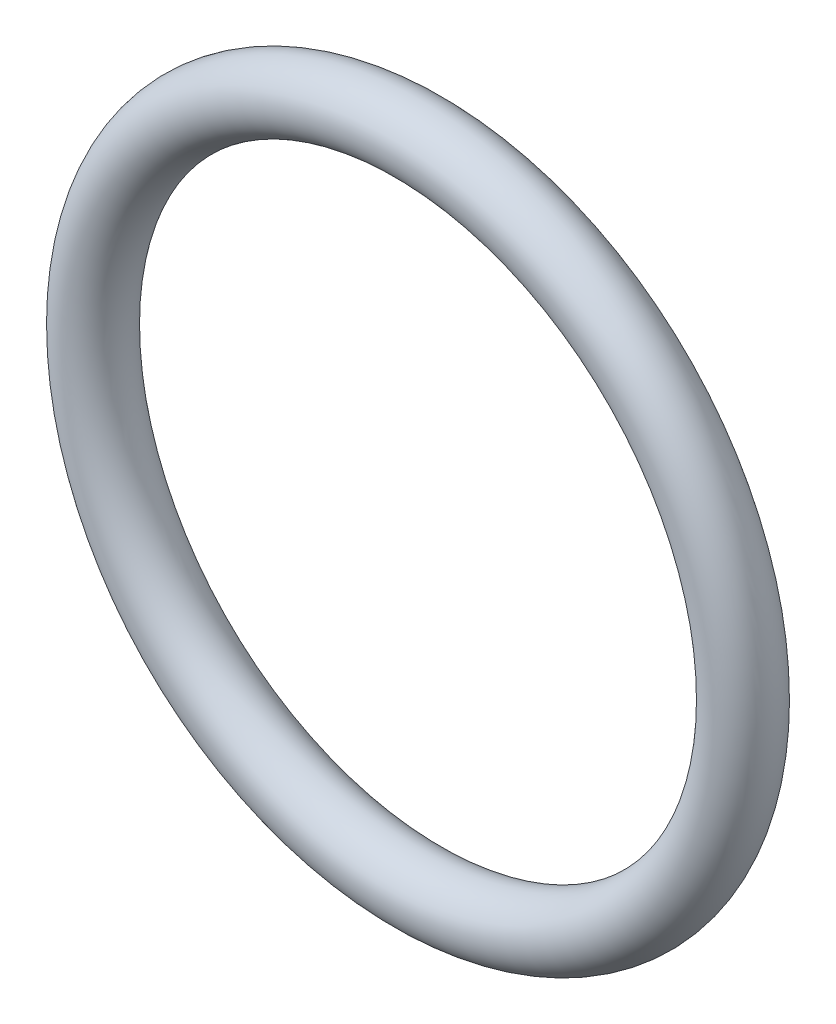
ISO-10303-21;
HEADER;
FILE_DESCRIPTION(('STEP AP214'),'2;1');
FILE_NAME('part.step','',(''),(''),'','','');
FILE_SCHEMA(('AUTOMOTIVE_DESIGN { 1 0 10303 214 1 1 1 1 }'));
ENDSEC;
DATA;
#1=APPLICATION_CONTEXT('core data for automotive mechanical design processes');
#2=APPLICATION_PROTOCOL_DEFINITION('international standard','automotive_design',2000,#1);
#3=PRODUCT_CONTEXT('',#1,'mechanical');
#4=PRODUCT('Part','Part','',(#3));
#5=PRODUCT_RELATED_PRODUCT_CATEGORY('part','',(#4));
#6=PRODUCT_DEFINITION_FORMATION('','',#4);
#7=PRODUCT_DEFINITION_CONTEXT('part definition',#1,'design');
#8=PRODUCT_DEFINITION('design','',#6,#7);
#9=PRODUCT_DEFINITION_SHAPE('','',#8);
#10=(LENGTH_UNIT() NAMED_UNIT(*) SI_UNIT(.MILLI.,.METRE.));
#11=(NAMED_UNIT(*) PLANE_ANGLE_UNIT() SI_UNIT($,.RADIAN.));
#12=(NAMED_UNIT(*) SI_UNIT($,.STERADIAN.) SOLID_ANGLE_UNIT());
#13=UNCERTAINTY_MEASURE_WITH_UNIT(LENGTH_MEASURE(1.E-05),#10,'distance_accuracy_value','');
#14=(GEOMETRIC_REPRESENTATION_CONTEXT(3) GLOBAL_UNCERTAINTY_ASSIGNED_CONTEXT((#13)) GLOBAL_UNIT_ASSIGNED_CONTEXT((#10,
#11,#12)) REPRESENTATION_CONTEXT('',''));
#15=CARTESIAN_POINT('',(0.,0.,0.));
#16=DIRECTION('',(0.,0.,1.));
#17=DIRECTION('',(1.,0.,0.));
#18=AXIS2_PLACEMENT_3D('',#15,#16,#17);
#19=CARTESIAN_POINT('',(0.,0.,0.));
#20=DIRECTION('',(0.,0.,1.));
#21=DIRECTION('',(1.,0.,0.));
#22=AXIS2_PLACEMENT_3D('',#19,#20,#21);
#23=TOROIDAL_SURFACE('',#22,17.4371,1.7653);
#24=CARTESIAN_POINT('',(19.2024,0.,0.));
#25=VERTEX_POINT('',#24);
#26=VERTEX_LOOP('',#25);
#27=FACE_BOUND('',#26,.T.);
#28=ADVANCED_FACE('F30',(#27),#23,.T.);
#29=CLOSED_SHELL('',(#28));
#30=MANIFOLD_SOLID_BREP('B2',#29);
#31=ADVANCED_BREP_SHAPE_REPRESENTATION('',(#18,#30),#14);
#32=SHAPE_DEFINITION_REPRESENTATION(#9,#31);
ENDSEC;
END-ISO-10303-21;
